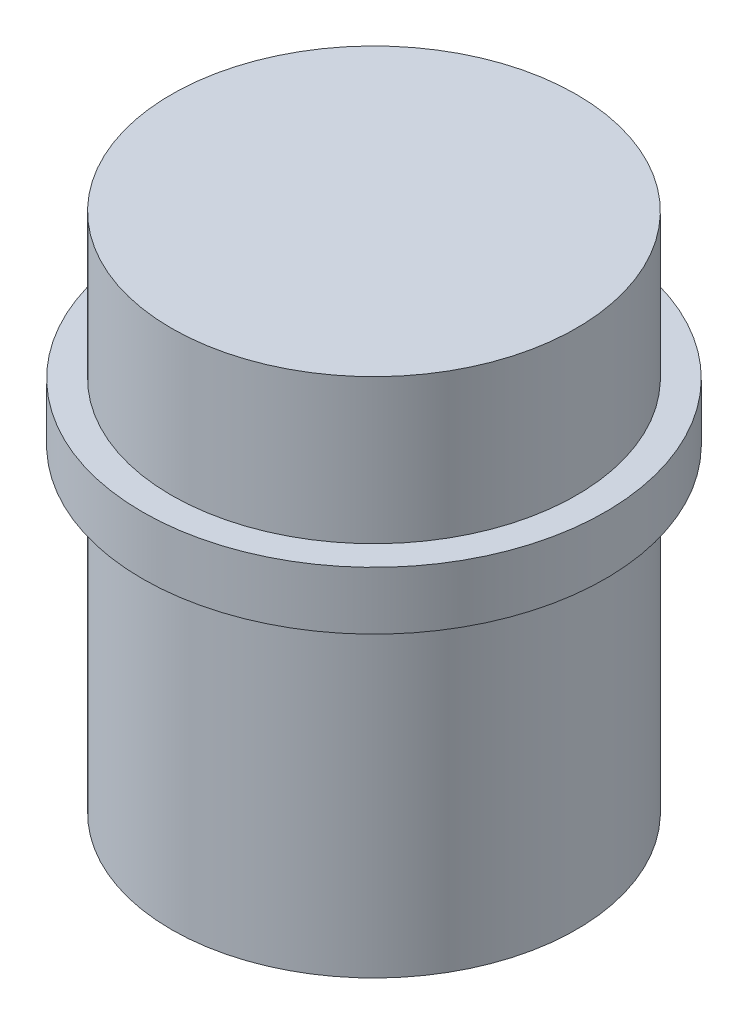
ISO-10303-21;
HEADER;
FILE_DESCRIPTION(('STEP AP214'),'2;1');
FILE_NAME('part.step','',(''),(''),'','','');
FILE_SCHEMA(('AUTOMOTIVE_DESIGN { 1 0 10303 214 1 1 1 1 }'));
ENDSEC;
DATA;
#1=APPLICATION_CONTEXT('core data for automotive mechanical design processes');
#2=APPLICATION_PROTOCOL_DEFINITION('international standard','automotive_design',2000,#1);
#3=PRODUCT_CONTEXT('',#1,'mechanical');
#4=PRODUCT('Part','Part','',(#3));
#5=PRODUCT_RELATED_PRODUCT_CATEGORY('part','',(#4));
#6=PRODUCT_DEFINITION_FORMATION('','',#4);
#7=PRODUCT_DEFINITION_CONTEXT('part definition',#1,'design');
#8=PRODUCT_DEFINITION('design','',#6,#7);
#9=PRODUCT_DEFINITION_SHAPE('','',#8);
#10=(LENGTH_UNIT() NAMED_UNIT(*) SI_UNIT(.MILLI.,.METRE.));
#11=(NAMED_UNIT(*) PLANE_ANGLE_UNIT() SI_UNIT($,.RADIAN.));
#12=(NAMED_UNIT(*) SI_UNIT($,.STERADIAN.) SOLID_ANGLE_UNIT());
#13=UNCERTAINTY_MEASURE_WITH_UNIT(LENGTH_MEASURE(1.E-05),#10,'distance_accuracy_value','');
#14=(GEOMETRIC_REPRESENTATION_CONTEXT(3) GLOBAL_UNCERTAINTY_ASSIGNED_CONTEXT((#13)) GLOBAL_UNIT_ASSIGNED_CONTEXT((#10,
#11,#12)) REPRESENTATION_CONTEXT('',''));
#15=CARTESIAN_POINT('',(0.,0.,0.));
#16=DIRECTION('',(0.,0.,1.));
#17=DIRECTION('',(1.,0.,0.));
#18=AXIS2_PLACEMENT_3D('',#15,#16,#17);
#19=CARTESIAN_POINT('',(0.,2.,0.));
#20=DIRECTION('',(0.,-1.,0.));
#21=DIRECTION('',(0.,0.,-1.));
#22=AXIS2_PLACEMENT_3D('',#19,#20,#21);
#23=CYLINDRICAL_SURFACE('',#22,8.);
#24=CARTESIAN_POINT('',(0.,2.,0.));
#25=DIRECTION('',(0.,1.,0.));
#26=DIRECTION('',(0.,0.,1.));
#27=AXIS2_PLACEMENT_3D('',#24,#25,#26);
#28=CIRCLE('',#27,8.);
#29=CARTESIAN_POINT('',(0.,2.,8.));
#30=VERTEX_POINT('',#29);
#31=EDGE_CURVE('E49',#30,#30,#28,.T.);
#32=ORIENTED_EDGE('',*,*,#31,.F.);
#33=EDGE_LOOP('',(#32));
#34=FACE_BOUND('',#33,.T.);
#35=CARTESIAN_POINT('',(0.,0.,0.));
#36=DIRECTION('',(0.,1.,0.));
#37=DIRECTION('',(0.,0.,1.));
#38=AXIS2_PLACEMENT_3D('',#35,#36,#37);
#39=CIRCLE('',#38,8.);
#40=CARTESIAN_POINT('',(0.,0.,8.));
#41=VERTEX_POINT('',#40);
#42=EDGE_CURVE('E55',#41,#41,#39,.T.);
#43=ORIENTED_EDGE('',*,*,#42,.T.);
#44=EDGE_LOOP('',(#43));
#45=FACE_BOUND('',#44,.T.);
#46=ADVANCED_FACE('F41',(#34,#45),#23,.T.);
#47=CARTESIAN_POINT('',(0.,2.,0.));
#48=DIRECTION('',(0.,1.,0.));
#49=DIRECTION('',(0.,0.,1.));
#50=AXIS2_PLACEMENT_3D('',#47,#48,#49);
#51=PLANE('',#50);
#52=CARTESIAN_POINT('',(0.,2.,0.));
#53=DIRECTION('',(0.,1.,0.));
#54=DIRECTION('',(0.,0.,1.));
#55=AXIS2_PLACEMENT_3D('',#52,#53,#54);
#56=CIRCLE('',#55,7.);
#57=CARTESIAN_POINT('',(0.,2.,7.));
#58=VERTEX_POINT('',#57);
#59=EDGE_CURVE('E10',#58,#58,#56,.T.);
#60=ORIENTED_EDGE('',*,*,#59,.F.);
#61=EDGE_LOOP('',(#60));
#62=FACE_BOUND('',#61,.T.);
#63=ORIENTED_EDGE('',*,*,#31,.T.);
#64=EDGE_LOOP('',(#63));
#65=FACE_BOUND('',#64,.T.);
#66=ADVANCED_FACE('F101',(#62,#65),#51,.T.);
#67=CARTESIAN_POINT('',(0.,0.,0.));
#68=DIRECTION('',(0.,1.,0.));
#69=DIRECTION('',(0.,0.,1.));
#70=AXIS2_PLACEMENT_3D('',#67,#68,#69);
#71=PLANE('',#70);
#72=CARTESIAN_POINT('',(0.,0.,0.));
#73=DIRECTION('',(0.,1.,0.));
#74=DIRECTION('',(0.,0.,1.));
#75=AXIS2_PLACEMENT_3D('',#72,#73,#74);
#76=CIRCLE('',#75,7.);
#77=CARTESIAN_POINT('',(0.,0.,7.));
#78=VERTEX_POINT('',#77);
#79=EDGE_CURVE('E44',#78,#78,#76,.T.);
#80=ORIENTED_EDGE('',*,*,#79,.T.);
#81=EDGE_LOOP('',(#80));
#82=FACE_BOUND('',#81,.T.);
#83=ORIENTED_EDGE('',*,*,#42,.F.);
#84=EDGE_LOOP('',(#83));
#85=FACE_BOUND('',#84,.T.);
#86=ADVANCED_FACE('F93',(#82,#85),#71,.F.);
#87=CARTESIAN_POINT('',(0.,-11.,0.));
#88=DIRECTION('',(0.,1.,0.));
#89=DIRECTION('',(0.,0.,1.));
#90=AXIS2_PLACEMENT_3D('',#87,#88,#89);
#91=PLANE('',#90);
#92=CARTESIAN_POINT('',(0.,-11.,0.));
#93=DIRECTION('',(0.,-1.,0.));
#94=DIRECTION('',(0.,0.,-1.));
#95=AXIS2_PLACEMENT_3D('',#92,#93,#94);
#96=CIRCLE('',#95,5.);
#97=CARTESIAN_POINT('',(0.,-11.,-5.));
#98=VERTEX_POINT('',#97);
#99=EDGE_CURVE('E80',#98,#98,#96,.T.);
#100=ORIENTED_EDGE('',*,*,#99,.F.);
#101=EDGE_LOOP('',(#100));
#102=FACE_BOUND('',#101,.T.);
#103=CARTESIAN_POINT('',(0.,-11.,0.));
#104=DIRECTION('',(0.,1.,0.));
#105=DIRECTION('',(0.,0.,1.));
#106=AXIS2_PLACEMENT_3D('',#103,#104,#105);
#107=CIRCLE('',#106,7.);
#108=CARTESIAN_POINT('',(0.,-11.,7.));
#109=VERTEX_POINT('',#108);
#110=EDGE_CURVE('E58',#109,#109,#107,.T.);
#111=ORIENTED_EDGE('',*,*,#110,.F.);
#112=EDGE_LOOP('',(#111));
#113=FACE_BOUND('',#112,.T.);
#114=ADVANCED_FACE('F89',(#102,#113),#91,.F.);
#115=CARTESIAN_POINT('',(0.,-11.,0.));
#116=DIRECTION('',(0.,1.,0.));
#117=DIRECTION('',(0.,0.,1.));
#118=AXIS2_PLACEMENT_3D('',#115,#116,#117);
#119=CYLINDRICAL_SURFACE('',#118,7.);
#120=ORIENTED_EDGE('',*,*,#110,.T.);
#121=EDGE_LOOP('',(#120));
#122=FACE_BOUND('',#121,.T.);
#123=ORIENTED_EDGE('',*,*,#79,.F.);
#124=EDGE_LOOP('',(#123));
#125=FACE_BOUND('',#124,.T.);
#126=ADVANCED_FACE('F92',(#122,#125),#119,.T.);
#127=ORIENTED_EDGE('',*,*,#59,.T.);
#128=EDGE_LOOP('',(#127));
#129=FACE_BOUND('',#128,.T.);
#130=CARTESIAN_POINT('',(0.,7.,0.));
#131=DIRECTION('',(0.,1.,0.));
#132=DIRECTION('',(0.,0.,1.));
#133=AXIS2_PLACEMENT_3D('',#130,#131,#132);
#134=CIRCLE('',#133,7.);
#135=CARTESIAN_POINT('',(0.,7.,7.));
#136=VERTEX_POINT('',#135);
#137=EDGE_CURVE('E70',#136,#136,#134,.T.);
#138=ORIENTED_EDGE('',*,*,#137,.F.);
#139=EDGE_LOOP('',(#138));
#140=FACE_BOUND('',#139,.T.);
#141=ADVANCED_FACE('F99',(#129,#140),#119,.T.);
#142=CARTESIAN_POINT('',(0.,7.,0.));
#143=DIRECTION('',(0.,1.,0.));
#144=DIRECTION('',(0.,0.,1.));
#145=AXIS2_PLACEMENT_3D('',#142,#143,#144);
#146=PLANE('',#145);
#147=ORIENTED_EDGE('',*,*,#137,.T.);
#148=EDGE_LOOP('',(#147));
#149=FACE_BOUND('',#148,.T.);
#150=ADVANCED_FACE('F115',(#149),#146,.T.);
#151=CARTESIAN_POINT('',(0.,-9.,0.));
#152=DIRECTION('',(0.,-1.,0.));
#153=DIRECTION('',(0.,0.,-1.));
#154=AXIS2_PLACEMENT_3D('',#151,#152,#153);
#155=CYLINDRICAL_SURFACE('',#154,5.);
#156=CARTESIAN_POINT('',(0.,-9.,0.));
#157=DIRECTION('',(0.,-1.,0.));
#158=DIRECTION('',(0.,0.,-1.));
#159=AXIS2_PLACEMENT_3D('',#156,#157,#158);
#160=CIRCLE('',#159,5.);
#161=CARTESIAN_POINT('',(0.,-9.,-5.));
#162=VERTEX_POINT('',#161);
#163=EDGE_CURVE('E75',#162,#162,#160,.T.);
#164=ORIENTED_EDGE('',*,*,#163,.F.);
#165=EDGE_LOOP('',(#164));
#166=FACE_BOUND('',#165,.T.);
#167=ORIENTED_EDGE('',*,*,#99,.T.);
#168=EDGE_LOOP('',(#167));
#169=FACE_BOUND('',#168,.T.);
#170=ADVANCED_FACE('F87',(#166,#169),#155,.F.);
#171=CARTESIAN_POINT('',(0.,-9.,0.));
#172=DIRECTION('',(0.,-1.,0.));
#173=DIRECTION('',(0.,0.,-1.));
#174=AXIS2_PLACEMENT_3D('',#171,#172,#173);
#175=PLANE('',#174);
#176=ORIENTED_EDGE('',*,*,#163,.T.);
#177=EDGE_LOOP('',(#176));
#178=FACE_BOUND('',#177,.T.);
#179=ADVANCED_FACE('F123',(#178),#175,.T.);
#180=CLOSED_SHELL('',(#46,#66,#86,#114,#126,#141,#150,#170,#179));
#181=MANIFOLD_SOLID_BREP('B2',#180);
#182=ADVANCED_BREP_SHAPE_REPRESENTATION('',(#18,#181),#14);
#183=SHAPE_DEFINITION_REPRESENTATION(#9,#182);
ENDSEC;
END-ISO-10303-21;
